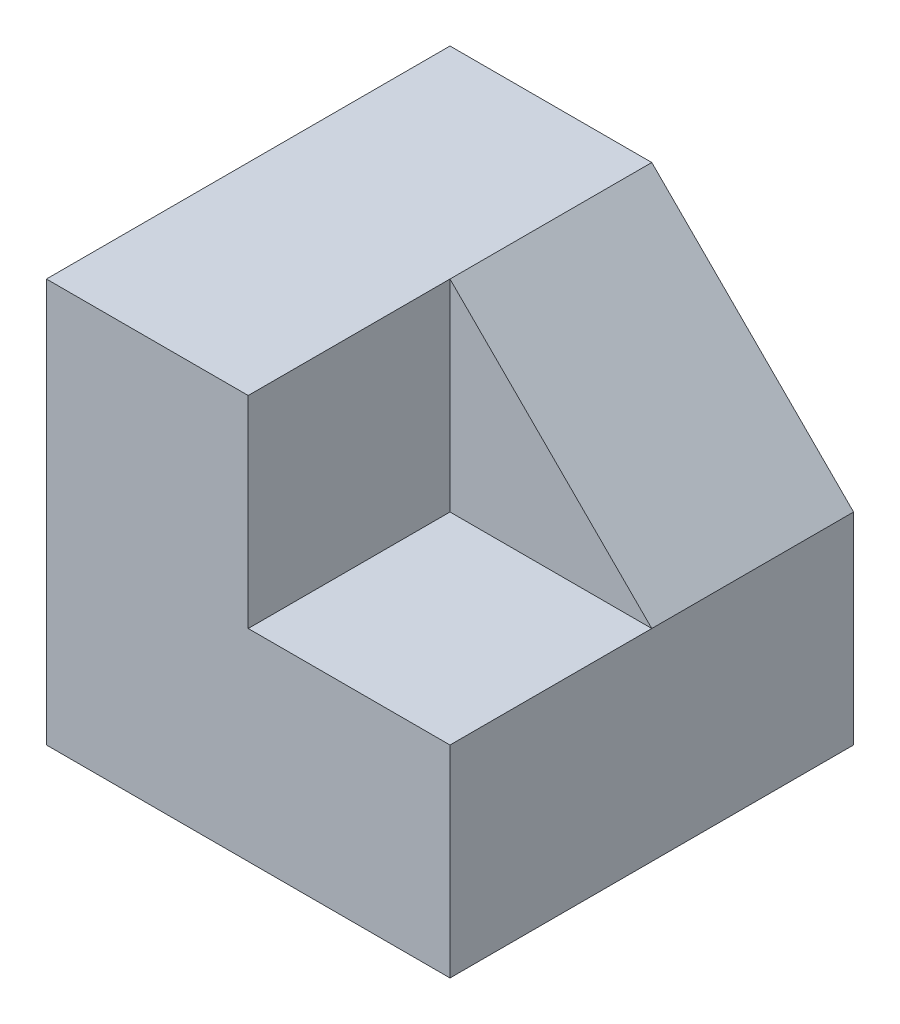
ISO-10303-21;
HEADER;
FILE_DESCRIPTION(('STEP AP214'),'2;1');
FILE_NAME('part.step','',(''),(''),'','','');
FILE_SCHEMA(('AUTOMOTIVE_DESIGN { 1 0 10303 214 1 1 1 1 }'));
ENDSEC;
DATA;
#1=APPLICATION_CONTEXT('core data for automotive mechanical design processes');
#2=APPLICATION_PROTOCOL_DEFINITION('international standard','automotive_design',2000,#1);
#3=PRODUCT_CONTEXT('',#1,'mechanical');
#4=PRODUCT('Part','Part','',(#3));
#5=PRODUCT_RELATED_PRODUCT_CATEGORY('part','',(#4));
#6=PRODUCT_DEFINITION_FORMATION('','',#4);
#7=PRODUCT_DEFINITION_CONTEXT('part definition',#1,'design');
#8=PRODUCT_DEFINITION('design','',#6,#7);
#9=PRODUCT_DEFINITION_SHAPE('','',#8);
#10=(LENGTH_UNIT() NAMED_UNIT(*) SI_UNIT(.MILLI.,.METRE.));
#11=(NAMED_UNIT(*) PLANE_ANGLE_UNIT() SI_UNIT($,.RADIAN.));
#12=(NAMED_UNIT(*) SI_UNIT($,.STERADIAN.) SOLID_ANGLE_UNIT());
#13=UNCERTAINTY_MEASURE_WITH_UNIT(LENGTH_MEASURE(1.E-05),#10,'distance_accuracy_value','');
#14=(GEOMETRIC_REPRESENTATION_CONTEXT(3) GLOBAL_UNCERTAINTY_ASSIGNED_CONTEXT((#13)) GLOBAL_UNIT_ASSIGNED_CONTEXT((#10,
#11,#12)) REPRESENTATION_CONTEXT('',''));
#15=CARTESIAN_POINT('',(0.,0.,0.));
#16=DIRECTION('',(0.,0.,1.));
#17=DIRECTION('',(1.,0.,0.));
#18=AXIS2_PLACEMENT_3D('',#15,#16,#17);
#19=CARTESIAN_POINT('',(60.,0.,-60.));
#20=DIRECTION('',(0.,-1.,0.));
#21=DIRECTION('',(0.,0.,-1.));
#22=AXIS2_PLACEMENT_3D('',#19,#20,#21);
#23=PLANE('',#22);
#24=DIRECTION('',(1.,0.,0.));
#25=VECTOR('',#24,1.);
#26=CARTESIAN_POINT('',(60.,0.,0.));
#27=LINE('',#26,#25);
#28=CARTESIAN_POINT('',(0.,0.,0.));
#29=VERTEX_POINT('',#28);
#30=CARTESIAN_POINT('',(60.,0.,0.));
#31=VERTEX_POINT('',#30);
#32=EDGE_CURVE('E114',#29,#31,#27,.T.);
#33=ORIENTED_EDGE('',*,*,#32,.F.);
#34=DIRECTION('',(0.,0.,1.));
#35=VECTOR('',#34,1.);
#36=CARTESIAN_POINT('',(0.,0.,-60.));
#37=LINE('',#36,#35);
#38=CARTESIAN_POINT('',(0.,0.,-60.));
#39=VERTEX_POINT('',#38);
#40=EDGE_CURVE('E11',#39,#29,#37,.T.);
#41=ORIENTED_EDGE('',*,*,#40,.F.);
#42=DIRECTION('',(1.,0.,0.));
#43=VECTOR('',#42,1.);
#44=CARTESIAN_POINT('',(60.,0.,-60.));
#45=LINE('',#44,#43);
#46=CARTESIAN_POINT('',(60.,0.,-60.));
#47=VERTEX_POINT('',#46);
#48=EDGE_CURVE('E109',#39,#47,#45,.T.);
#49=ORIENTED_EDGE('',*,*,#48,.T.);
#50=DIRECTION('',(0.,0.,1.));
#51=VECTOR('',#50,1.);
#52=CARTESIAN_POINT('',(60.,0.,-60.));
#53=LINE('',#52,#51);
#54=EDGE_CURVE('E36',#47,#31,#53,.T.);
#55=ORIENTED_EDGE('',*,*,#54,.T.);
#56=EDGE_LOOP('',(#33,#41,#49,#55));
#57=FACE_BOUND('',#56,.T.);
#58=ADVANCED_FACE('F33',(#57),#23,.T.);
#59=CARTESIAN_POINT('',(0.,0.,-60.));
#60=DIRECTION('',(-1.,0.,0.));
#61=DIRECTION('',(0.,0.,1.));
#62=AXIS2_PLACEMENT_3D('',#59,#60,#61);
#63=PLANE('',#62);
#64=DIRECTION('',(0.,-1.,0.));
#65=VECTOR('',#64,1.);
#66=CARTESIAN_POINT('',(0.,0.,0.));
#67=LINE('',#66,#65);
#68=CARTESIAN_POINT('',(0.,60.,0.));
#69=VERTEX_POINT('',#68);
#70=EDGE_CURVE('E123',#69,#29,#67,.T.);
#71=ORIENTED_EDGE('',*,*,#70,.F.);
#72=DIRECTION('',(0.,0.,1.));
#73=VECTOR('',#72,1.);
#74=CARTESIAN_POINT('',(0.,60.,-60.));
#75=LINE('',#74,#73);
#76=CARTESIAN_POINT('',(0.,60.,-60.));
#77=VERTEX_POINT('',#76);
#78=EDGE_CURVE('E42',#77,#69,#75,.T.);
#79=ORIENTED_EDGE('',*,*,#78,.F.);
#80=DIRECTION('',(0.,-1.,0.));
#81=VECTOR('',#80,1.);
#82=CARTESIAN_POINT('',(0.,0.,-60.));
#83=LINE('',#82,#81);
#84=EDGE_CURVE('E103',#77,#39,#83,.T.);
#85=ORIENTED_EDGE('',*,*,#84,.T.);
#86=ORIENTED_EDGE('',*,*,#40,.T.);
#87=EDGE_LOOP('',(#71,#79,#85,#86));
#88=FACE_BOUND('',#87,.T.);
#89=ADVANCED_FACE('F136',(#88),#63,.T.);
#90=CARTESIAN_POINT('',(0.,60.,-60.));
#91=DIRECTION('',(0.,1.,0.));
#92=DIRECTION('',(0.,0.,1.));
#93=AXIS2_PLACEMENT_3D('',#90,#91,#92);
#94=PLANE('',#93);
#95=DIRECTION('',(-1.,0.,0.));
#96=VECTOR('',#95,1.);
#97=CARTESIAN_POINT('',(0.,60.,0.));
#98=LINE('',#97,#96);
#99=CARTESIAN_POINT('',(30.,60.,0.));
#100=VERTEX_POINT('',#99);
#101=EDGE_CURVE('E121',#100,#69,#98,.T.);
#102=ORIENTED_EDGE('',*,*,#101,.F.);
#103=DIRECTION('',(0.,0.,1.));
#104=VECTOR('',#103,1.);
#105=CARTESIAN_POINT('',(30.,60.,-30.));
#106=LINE('',#105,#104);
#107=CARTESIAN_POINT('',(30.,60.,-30.));
#108=VERTEX_POINT('',#107);
#109=EDGE_CURVE('E93',#108,#100,#106,.T.);
#110=ORIENTED_EDGE('',*,*,#109,.F.);
#111=DIRECTION('',(0.,0.,1.));
#112=VECTOR('',#111,1.);
#113=CARTESIAN_POINT('',(30.,60.,-60.));
#114=LINE('',#113,#112);
#115=CARTESIAN_POINT('',(30.,60.,-60.));
#116=VERTEX_POINT('',#115);
#117=EDGE_CURVE('E87',#116,#108,#114,.T.);
#118=ORIENTED_EDGE('',*,*,#117,.F.);
#119=DIRECTION('',(-1.,0.,0.));
#120=VECTOR('',#119,1.);
#121=CARTESIAN_POINT('',(0.,60.,-60.));
#122=LINE('',#121,#120);
#123=EDGE_CURVE('E90',#116,#77,#122,.T.);
#124=ORIENTED_EDGE('',*,*,#123,.T.);
#125=ORIENTED_EDGE('',*,*,#78,.T.);
#126=EDGE_LOOP('',(#102,#110,#118,#124,#125));
#127=FACE_BOUND('',#126,.T.);
#128=ADVANCED_FACE('F89',(#127),#94,.T.);
#129=CARTESIAN_POINT('',(30.,60.,-60.));
#130=DIRECTION('',(0.707106781186547,0.707106781186547,0.));
#131=DIRECTION('',(-0.707106781186548,0.707106781186548,0.));
#132=AXIS2_PLACEMENT_3D('',#129,#130,#131);
#133=PLANE('',#132);
#134=DIRECTION('',(-0.707106781186547,0.707106781186547,0.));
#135=VECTOR('',#134,1.);
#136=CARTESIAN_POINT('',(60.,30.,-30.));
#137=LINE('',#136,#135);
#138=CARTESIAN_POINT('',(60.,30.,-30.));
#139=VERTEX_POINT('',#138);
#140=EDGE_CURVE('E174',#139,#108,#137,.T.);
#141=ORIENTED_EDGE('',*,*,#140,.F.);
#142=DIRECTION('',(0.,0.,1.));
#143=VECTOR('',#142,1.);
#144=CARTESIAN_POINT('',(60.,30.,-60.));
#145=LINE('',#144,#143);
#146=CARTESIAN_POINT('',(60.,30.,-60.));
#147=VERTEX_POINT('',#146);
#148=EDGE_CURVE('E97',#147,#139,#145,.T.);
#149=ORIENTED_EDGE('',*,*,#148,.F.);
#150=DIRECTION('',(-0.707106781186547,0.707106781186547,0.));
#151=VECTOR('',#150,1.);
#152=CARTESIAN_POINT('',(30.,60.,-60.));
#153=LINE('',#152,#151);
#154=EDGE_CURVE('E102',#147,#116,#153,.T.);
#155=ORIENTED_EDGE('',*,*,#154,.T.);
#156=ORIENTED_EDGE('',*,*,#117,.T.);
#157=EDGE_LOOP('',(#141,#149,#155,#156));
#158=FACE_BOUND('',#157,.T.);
#159=ADVANCED_FACE('F105',(#158),#133,.T.);
#160=CARTESIAN_POINT('',(60.,30.,-60.));
#161=DIRECTION('',(1.,0.,0.));
#162=DIRECTION('',(0.,0.,-1.));
#163=AXIS2_PLACEMENT_3D('',#160,#161,#162);
#164=PLANE('',#163);
#165=DIRECTION('',(0.,1.,0.));
#166=VECTOR('',#165,1.);
#167=CARTESIAN_POINT('',(60.,30.,0.));
#168=LINE('',#167,#166);
#169=CARTESIAN_POINT('',(60.,30.,0.));
#170=VERTEX_POINT('',#169);
#171=EDGE_CURVE('E117',#31,#170,#168,.T.);
#172=ORIENTED_EDGE('',*,*,#171,.F.);
#173=ORIENTED_EDGE('',*,*,#54,.F.);
#174=DIRECTION('',(0.,1.,0.));
#175=VECTOR('',#174,1.);
#176=CARTESIAN_POINT('',(60.,30.,-60.));
#177=LINE('',#176,#175);
#178=EDGE_CURVE('E107',#47,#147,#177,.T.);
#179=ORIENTED_EDGE('',*,*,#178,.T.);
#180=ORIENTED_EDGE('',*,*,#148,.T.);
#181=DIRECTION('',(0.,0.,1.));
#182=VECTOR('',#181,1.);
#183=CARTESIAN_POINT('',(60.,30.,-30.));
#184=LINE('',#183,#182);
#185=EDGE_CURVE('E131',#139,#170,#184,.T.);
#186=ORIENTED_EDGE('',*,*,#185,.T.);
#187=EDGE_LOOP('',(#172,#173,#179,#180,#186));
#188=FACE_BOUND('',#187,.T.);
#189=ADVANCED_FACE('F128',(#188),#164,.T.);
#190=CARTESIAN_POINT('',(0.,0.,-60.));
#191=DIRECTION('',(0.,0.,-1.));
#192=DIRECTION('',(-1.,0.,0.));
#193=AXIS2_PLACEMENT_3D('',#190,#191,#192);
#194=PLANE('',#193);
#195=ORIENTED_EDGE('',*,*,#48,.F.);
#196=ORIENTED_EDGE('',*,*,#84,.F.);
#197=ORIENTED_EDGE('',*,*,#123,.F.);
#198=ORIENTED_EDGE('',*,*,#154,.F.);
#199=ORIENTED_EDGE('',*,*,#178,.F.);
#200=EDGE_LOOP('',(#195,#196,#197,#198,#199));
#201=FACE_BOUND('',#200,.T.);
#202=ADVANCED_FACE('F101',(#201),#194,.T.);
#203=CARTESIAN_POINT('',(0.,0.,0.));
#204=DIRECTION('',(0.,0.,-1.));
#205=DIRECTION('',(-1.,0.,0.));
#206=AXIS2_PLACEMENT_3D('',#203,#204,#205);
#207=PLANE('',#206);
#208=ORIENTED_EDGE('',*,*,#171,.T.);
#209=DIRECTION('',(1.,0.,0.));
#210=VECTOR('',#209,1.);
#211=CARTESIAN_POINT('',(30.,30.,0.));
#212=LINE('',#211,#210);
#213=CARTESIAN_POINT('',(30.,30.,0.));
#214=VERTEX_POINT('',#213);
#215=EDGE_CURVE('E184',#214,#170,#212,.T.);
#216=ORIENTED_EDGE('',*,*,#215,.F.);
#217=DIRECTION('',(0.,-1.,0.));
#218=VECTOR('',#217,1.);
#219=CARTESIAN_POINT('',(30.,60.,0.));
#220=LINE('',#219,#218);
#221=EDGE_CURVE('E179',#100,#214,#220,.T.);
#222=ORIENTED_EDGE('',*,*,#221,.F.);
#223=ORIENTED_EDGE('',*,*,#101,.T.);
#224=ORIENTED_EDGE('',*,*,#70,.T.);
#225=ORIENTED_EDGE('',*,*,#32,.T.);
#226=EDGE_LOOP('',(#208,#216,#222,#223,#224,#225));
#227=FACE_BOUND('',#226,.T.);
#228=ADVANCED_FACE('F134',(#227),#207,.F.);
#229=CARTESIAN_POINT('',(30.,30.,-30.));
#230=DIRECTION('',(0.,-1.,0.));
#231=DIRECTION('',(0.,0.,-1.));
#232=AXIS2_PLACEMENT_3D('',#229,#230,#231);
#233=PLANE('',#232);
#234=ORIENTED_EDGE('',*,*,#215,.T.);
#235=ORIENTED_EDGE('',*,*,#185,.F.);
#236=DIRECTION('',(1.,0.,0.));
#237=VECTOR('',#236,1.);
#238=CARTESIAN_POINT('',(30.,30.,-30.));
#239=LINE('',#238,#237);
#240=CARTESIAN_POINT('',(30.,30.,-30.));
#241=VERTEX_POINT('',#240);
#242=EDGE_CURVE('E173',#241,#139,#239,.T.);
#243=ORIENTED_EDGE('',*,*,#242,.F.);
#244=DIRECTION('',(0.,0.,1.));
#245=VECTOR('',#244,1.);
#246=CARTESIAN_POINT('',(30.,30.,-30.));
#247=LINE('',#246,#245);
#248=EDGE_CURVE('E118',#241,#214,#247,.T.);
#249=ORIENTED_EDGE('',*,*,#248,.T.);
#250=EDGE_LOOP('',(#234,#235,#243,#249));
#251=FACE_BOUND('',#250,.T.);
#252=ADVANCED_FACE('F155',(#251),#233,.F.);
#253=CARTESIAN_POINT('',(30.,60.,-30.));
#254=DIRECTION('',(-1.,0.,0.));
#255=DIRECTION('',(0.,0.,1.));
#256=AXIS2_PLACEMENT_3D('',#253,#254,#255);
#257=PLANE('',#256);
#258=ORIENTED_EDGE('',*,*,#221,.T.);
#259=ORIENTED_EDGE('',*,*,#248,.F.);
#260=DIRECTION('',(0.,-1.,0.));
#261=VECTOR('',#260,1.);
#262=CARTESIAN_POINT('',(30.,60.,-30.));
#263=LINE('',#262,#261);
#264=EDGE_CURVE('E176',#108,#241,#263,.T.);
#265=ORIENTED_EDGE('',*,*,#264,.F.);
#266=ORIENTED_EDGE('',*,*,#109,.T.);
#267=EDGE_LOOP('',(#258,#259,#265,#266));
#268=FACE_BOUND('',#267,.T.);
#269=ADVANCED_FACE('F159',(#268),#257,.F.);
#270=CARTESIAN_POINT('',(0.,0.,-30.));
#271=DIRECTION('',(0.,0.,-1.));
#272=DIRECTION('',(-1.,0.,0.));
#273=AXIS2_PLACEMENT_3D('',#270,#271,#272);
#274=PLANE('',#273);
#275=ORIENTED_EDGE('',*,*,#242,.T.);
#276=ORIENTED_EDGE('',*,*,#140,.T.);
#277=ORIENTED_EDGE('',*,*,#264,.T.);
#278=EDGE_LOOP('',(#275,#276,#277));
#279=FACE_BOUND('',#278,.T.);
#280=ADVANCED_FACE('F163',(#279),#274,.F.);
#281=CLOSED_SHELL('',(#58,#89,#128,#159,#189,#202,#228,#252,#269,#280));
#282=MANIFOLD_SOLID_BREP('B2',#281);
#283=ADVANCED_BREP_SHAPE_REPRESENTATION('',(#18,#282),#14);
#284=SHAPE_DEFINITION_REPRESENTATION(#9,#283);
ENDSEC;
END-ISO-10303-21;
